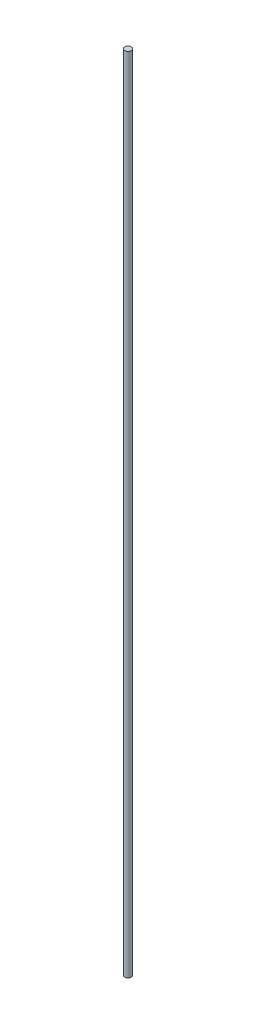
ISO-10303-21;
HEADER;
FILE_DESCRIPTION(('STEP AP214'),'2;1');
FILE_NAME('part.step','',(''),(''),'','','');
FILE_SCHEMA(('AUTOMOTIVE_DESIGN { 1 0 10303 214 1 1 1 1 }'));
ENDSEC;
DATA;
#1=APPLICATION_CONTEXT('core data for automotive mechanical design processes');
#2=APPLICATION_PROTOCOL_DEFINITION('international standard','automotive_design',2000,#1);
#3=PRODUCT_CONTEXT('',#1,'mechanical');
#4=PRODUCT('Part','Part','',(#3));
#5=PRODUCT_RELATED_PRODUCT_CATEGORY('part','',(#4));
#6=PRODUCT_DEFINITION_FORMATION('','',#4);
#7=PRODUCT_DEFINITION_CONTEXT('part definition',#1,'design');
#8=PRODUCT_DEFINITION('design','',#6,#7);
#9=PRODUCT_DEFINITION_SHAPE('','',#8);
#10=(LENGTH_UNIT() NAMED_UNIT(*) SI_UNIT(.MILLI.,.METRE.));
#11=(NAMED_UNIT(*) PLANE_ANGLE_UNIT() SI_UNIT($,.RADIAN.));
#12=(NAMED_UNIT(*) SI_UNIT($,.STERADIAN.) SOLID_ANGLE_UNIT());
#13=UNCERTAINTY_MEASURE_WITH_UNIT(LENGTH_MEASURE(1.E-05),#10,'distance_accuracy_value','');
#14=(GEOMETRIC_REPRESENTATION_CONTEXT(3) GLOBAL_UNCERTAINTY_ASSIGNED_CONTEXT((#13)) GLOBAL_UNIT_ASSIGNED_CONTEXT((#10,
#11,#12)) REPRESENTATION_CONTEXT('',''));
#15=CARTESIAN_POINT('',(0.,0.,0.));
#16=DIRECTION('',(0.,0.,1.));
#17=DIRECTION('',(1.,0.,0.));
#18=AXIS2_PLACEMENT_3D('',#15,#16,#17);
#19=CARTESIAN_POINT('',(0.,387.35,0.));
#20=DIRECTION('',(0.,-1.,0.));
#21=DIRECTION('',(0.,0.,-1.));
#22=AXIS2_PLACEMENT_3D('',#19,#20,#21);
#23=CYLINDRICAL_SURFACE('',#22,3.175);
#24=CARTESIAN_POINT('',(0.,387.35,0.));
#25=DIRECTION('',(0.,1.,0.));
#26=DIRECTION('',(0.,0.,1.));
#27=AXIS2_PLACEMENT_3D('',#24,#25,#26);
#28=CIRCLE('',#27,3.175);
#29=CARTESIAN_POINT('',(0.,387.35,3.175));
#30=VERTEX_POINT('',#29);
#31=EDGE_CURVE('E10',#30,#30,#28,.T.);
#32=ORIENTED_EDGE('',*,*,#31,.F.);
#33=EDGE_LOOP('',(#32));
#34=FACE_BOUND('',#33,.T.);
#35=CARTESIAN_POINT('',(0.,-387.35,0.));
#36=DIRECTION('',(0.,1.,0.));
#37=DIRECTION('',(0.,0.,1.));
#38=AXIS2_PLACEMENT_3D('',#35,#36,#37);
#39=CIRCLE('',#38,3.175);
#40=CARTESIAN_POINT('',(0.,-387.35,3.175));
#41=VERTEX_POINT('',#40);
#42=EDGE_CURVE('E44',#41,#41,#39,.T.);
#43=ORIENTED_EDGE('',*,*,#42,.T.);
#44=EDGE_LOOP('',(#43));
#45=FACE_BOUND('',#44,.T.);
#46=ADVANCED_FACE('F41',(#34,#45),#23,.T.);
#47=CARTESIAN_POINT('',(0.,387.35,0.));
#48=DIRECTION('',(0.,1.,0.));
#49=DIRECTION('',(0.,0.,1.));
#50=AXIS2_PLACEMENT_3D('',#47,#48,#49);
#51=PLANE('',#50);
#52=ORIENTED_EDGE('',*,*,#31,.T.);
#53=EDGE_LOOP('',(#52));
#54=FACE_BOUND('',#53,.T.);
#55=ADVANCED_FACE('F58',(#54),#51,.T.);
#56=CARTESIAN_POINT('',(0.,-387.35,0.));
#57=DIRECTION('',(0.,1.,0.));
#58=DIRECTION('',(0.,0.,1.));
#59=AXIS2_PLACEMENT_3D('',#56,#57,#58);
#60=PLANE('',#59);
#61=ORIENTED_EDGE('',*,*,#42,.F.);
#62=EDGE_LOOP('',(#61));
#63=FACE_BOUND('',#62,.T.);
#64=ADVANCED_FACE('F56',(#63),#60,.F.);
#65=CLOSED_SHELL('',(#46,#55,#64));
#66=MANIFOLD_SOLID_BREP('B2',#65);
#67=ADVANCED_BREP_SHAPE_REPRESENTATION('',(#18,#66),#14);
#68=SHAPE_DEFINITION_REPRESENTATION(#9,#67);
ENDSEC;
END-ISO-10303-21;
